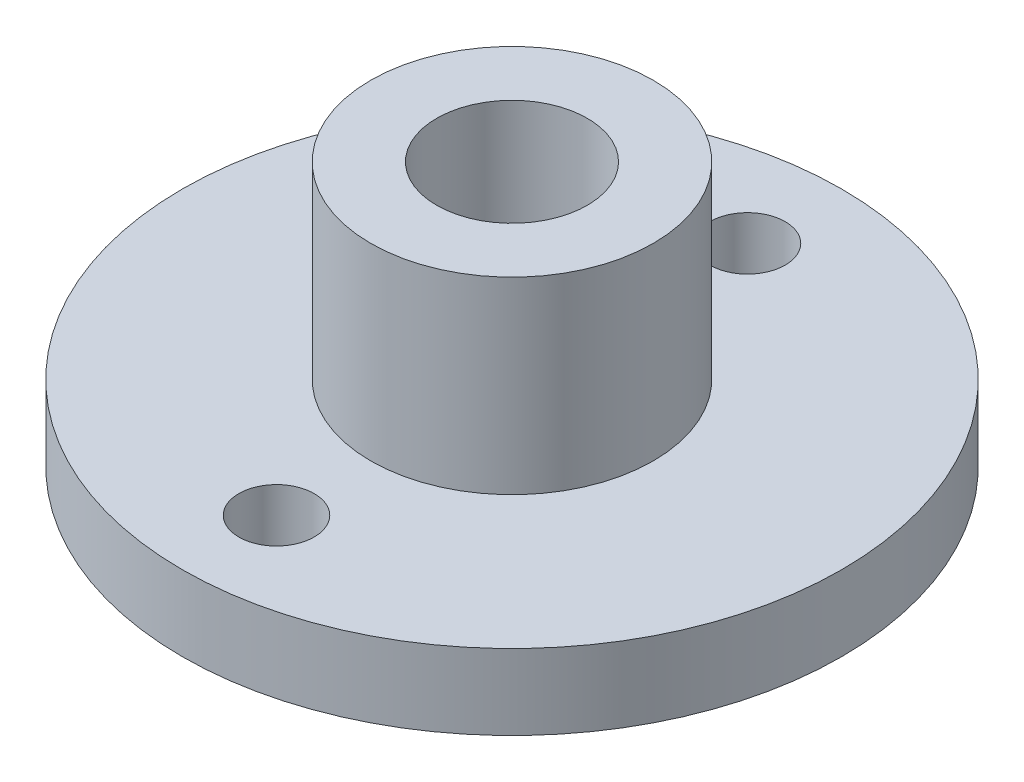
ISO-10303-21;
HEADER;
FILE_DESCRIPTION(('STEP AP214'),'2;1');
FILE_NAME('part.step','',(''),(''),'','','');
FILE_SCHEMA(('AUTOMOTIVE_DESIGN { 1 0 10303 214 1 1 1 1 }'));
ENDSEC;
DATA;
#1=APPLICATION_CONTEXT('core data for automotive mechanical design processes');
#2=APPLICATION_PROTOCOL_DEFINITION('international standard','automotive_design',2000,#1);
#3=PRODUCT_CONTEXT('',#1,'mechanical');
#4=PRODUCT('Part','Part','',(#3));
#5=PRODUCT_RELATED_PRODUCT_CATEGORY('part','',(#4));
#6=PRODUCT_DEFINITION_FORMATION('','',#4);
#7=PRODUCT_DEFINITION_CONTEXT('part definition',#1,'design');
#8=PRODUCT_DEFINITION('design','',#6,#7);
#9=PRODUCT_DEFINITION_SHAPE('','',#8);
#10=(LENGTH_UNIT() NAMED_UNIT(*) SI_UNIT(.MILLI.,.METRE.));
#11=(NAMED_UNIT(*) PLANE_ANGLE_UNIT() SI_UNIT($,.RADIAN.));
#12=(NAMED_UNIT(*) SI_UNIT($,.STERADIAN.) SOLID_ANGLE_UNIT());
#13=UNCERTAINTY_MEASURE_WITH_UNIT(LENGTH_MEASURE(1.E-05),#10,'distance_accuracy_value','');
#14=(GEOMETRIC_REPRESENTATION_CONTEXT(3) GLOBAL_UNCERTAINTY_ASSIGNED_CONTEXT((#13)) GLOBAL_UNIT_ASSIGNED_CONTEXT((#10,
#11,#12)) REPRESENTATION_CONTEXT('',''));
#15=CARTESIAN_POINT('',(0.,0.,0.));
#16=DIRECTION('',(0.,0.,1.));
#17=DIRECTION('',(1.,0.,0.));
#18=AXIS2_PLACEMENT_3D('',#15,#16,#17);
#19=CARTESIAN_POINT('',(0.,4.,0.));
#20=DIRECTION('',(0.,1.,0.));
#21=DIRECTION('',(0.,0.,1.));
#22=AXIS2_PLACEMENT_3D('',#19,#20,#21);
#23=PLANE('',#22);
#24=CARTESIAN_POINT('',(0.,4.,0.));
#25=DIRECTION('',(0.,1.,0.));
#26=DIRECTION('',(0.,0.,1.));
#27=AXIS2_PLACEMENT_3D('',#24,#25,#26);
#28=CIRCLE('',#27,7.5);
#29=CARTESIAN_POINT('',(0.,4.,7.5));
#30=VERTEX_POINT('',#29);
#31=EDGE_CURVE('E74',#30,#30,#28,.T.);
#32=ORIENTED_EDGE('',*,*,#31,.F.);
#33=EDGE_LOOP('',(#32));
#34=FACE_BOUND('',#33,.T.);
#35=CARTESIAN_POINT('',(0.,4.,-12.5));
#36=DIRECTION('',(0.,1.,0.));
#37=DIRECTION('',(0.,0.,1.));
#38=AXIS2_PLACEMENT_3D('',#35,#36,#37);
#39=CIRCLE('',#38,2.);
#40=CARTESIAN_POINT('',(0.,4.,-10.5));
#41=VERTEX_POINT('',#40);
#42=EDGE_CURVE('E56',#41,#41,#39,.T.);
#43=ORIENTED_EDGE('',*,*,#42,.F.);
#44=EDGE_LOOP('',(#43));
#45=FACE_BOUND('',#44,.T.);
#46=CARTESIAN_POINT('',(0.,4.,0.));
#47=DIRECTION('',(0.,1.,0.));
#48=DIRECTION('',(0.,0.,1.));
#49=AXIS2_PLACEMENT_3D('',#46,#47,#48);
#50=CIRCLE('',#49,17.5);
#51=CARTESIAN_POINT('',(0.,4.,17.5));
#52=VERTEX_POINT('',#51);
#53=EDGE_CURVE('E45',#52,#52,#50,.T.);
#54=ORIENTED_EDGE('',*,*,#53,.T.);
#55=EDGE_LOOP('',(#54));
#56=FACE_BOUND('',#55,.T.);
#57=CARTESIAN_POINT('',(0.,4.,12.5));
#58=DIRECTION('',(0.,1.,0.));
#59=DIRECTION('',(0.,0.,1.));
#60=AXIS2_PLACEMENT_3D('',#57,#58,#59);
#61=CIRCLE('',#60,2.);
#62=CARTESIAN_POINT('',(0.,4.,14.5));
#63=VERTEX_POINT('',#62);
#64=EDGE_CURVE('E62',#63,#63,#61,.T.);
#65=ORIENTED_EDGE('',*,*,#64,.F.);
#66=EDGE_LOOP('',(#65));
#67=FACE_BOUND('',#66,.T.);
#68=ADVANCED_FACE('F37',(#34,#45,#56,#67),#23,.T.);
#69=CARTESIAN_POINT('',(0.,0.,0.));
#70=DIRECTION('',(0.,1.,0.));
#71=DIRECTION('',(0.,0.,1.));
#72=AXIS2_PLACEMENT_3D('',#69,#70,#71);
#73=PLANE('',#72);
#74=CARTESIAN_POINT('',(0.,0.,0.));
#75=DIRECTION('',(0.,1.,0.));
#76=DIRECTION('',(0.,0.,1.));
#77=AXIS2_PLACEMENT_3D('',#74,#75,#76);
#78=CIRCLE('',#77,17.5);
#79=CARTESIAN_POINT('',(0.,0.,17.5));
#80=VERTEX_POINT('',#79);
#81=EDGE_CURVE('E50',#80,#80,#78,.T.);
#82=ORIENTED_EDGE('',*,*,#81,.F.);
#83=EDGE_LOOP('',(#82));
#84=FACE_BOUND('',#83,.T.);
#85=CARTESIAN_POINT('',(0.,0.,-12.5));
#86=DIRECTION('',(0.,1.,0.));
#87=DIRECTION('',(0.,0.,1.));
#88=AXIS2_PLACEMENT_3D('',#85,#86,#87);
#89=CIRCLE('',#88,2.);
#90=CARTESIAN_POINT('',(0.,0.,-10.5));
#91=VERTEX_POINT('',#90);
#92=EDGE_CURVE('E58',#91,#91,#89,.T.);
#93=ORIENTED_EDGE('',*,*,#92,.T.);
#94=EDGE_LOOP('',(#93));
#95=FACE_BOUND('',#94,.T.);
#96=CARTESIAN_POINT('',(0.,0.,12.5));
#97=DIRECTION('',(0.,1.,0.));
#98=DIRECTION('',(0.,0.,1.));
#99=AXIS2_PLACEMENT_3D('',#96,#97,#98);
#100=CIRCLE('',#99,2.);
#101=CARTESIAN_POINT('',(0.,0.,14.5));
#102=VERTEX_POINT('',#101);
#103=EDGE_CURVE('E66',#102,#102,#100,.T.);
#104=ORIENTED_EDGE('',*,*,#103,.T.);
#105=EDGE_LOOP('',(#104));
#106=FACE_BOUND('',#105,.T.);
#107=ADVANCED_FACE('F105',(#84,#95,#106),#73,.F.);
#108=CARTESIAN_POINT('',(0.,4.,0.));
#109=DIRECTION('',(0.,-1.,0.));
#110=DIRECTION('',(0.,0.,-1.));
#111=AXIS2_PLACEMENT_3D('',#108,#109,#110);
#112=CYLINDRICAL_SURFACE('',#111,17.5);
#113=ORIENTED_EDGE('',*,*,#53,.F.);
#114=EDGE_LOOP('',(#113));
#115=FACE_BOUND('',#114,.T.);
#116=ORIENTED_EDGE('',*,*,#81,.T.);
#117=EDGE_LOOP('',(#116));
#118=FACE_BOUND('',#117,.T.);
#119=ADVANCED_FACE('F39',(#115,#118),#112,.T.);
#120=CARTESIAN_POINT('',(0.,4.,-12.5));
#121=DIRECTION('',(0.,-1.,0.));
#122=DIRECTION('',(0.,0.,-1.));
#123=AXIS2_PLACEMENT_3D('',#120,#121,#122);
#124=CYLINDRICAL_SURFACE('',#123,2.);
#125=ORIENTED_EDGE('',*,*,#42,.T.);
#126=EDGE_LOOP('',(#125));
#127=FACE_BOUND('',#126,.T.);
#128=ORIENTED_EDGE('',*,*,#92,.F.);
#129=EDGE_LOOP('',(#128));
#130=FACE_BOUND('',#129,.T.);
#131=ADVANCED_FACE('F100',(#127,#130),#124,.F.);
#132=CARTESIAN_POINT('',(0.,4.,12.5));
#133=DIRECTION('',(0.,-1.,0.));
#134=DIRECTION('',(0.,0.,-1.));
#135=AXIS2_PLACEMENT_3D('',#132,#133,#134);
#136=CYLINDRICAL_SURFACE('',#135,2.);
#137=ORIENTED_EDGE('',*,*,#64,.T.);
#138=EDGE_LOOP('',(#137));
#139=FACE_BOUND('',#138,.T.);
#140=ORIENTED_EDGE('',*,*,#103,.F.);
#141=EDGE_LOOP('',(#140));
#142=FACE_BOUND('',#141,.T.);
#143=ADVANCED_FACE('F91',(#139,#142),#136,.F.);
#144=CARTESIAN_POINT('',(0.,14.,0.));
#145=DIRECTION('',(0.,1.,0.));
#146=DIRECTION('',(0.,0.,1.));
#147=AXIS2_PLACEMENT_3D('',#144,#145,#146);
#148=PLANE('',#147);
#149=CARTESIAN_POINT('',(0.,14.,0.));
#150=DIRECTION('',(0.,1.,0.));
#151=DIRECTION('',(0.,0.,1.));
#152=AXIS2_PLACEMENT_3D('',#149,#150,#151);
#153=CIRCLE('',#152,7.5);
#154=CARTESIAN_POINT('',(0.,14.,7.5));
#155=VERTEX_POINT('',#154);
#156=EDGE_CURVE('E70',#155,#155,#153,.T.);
#157=ORIENTED_EDGE('',*,*,#156,.T.);
#158=EDGE_LOOP('',(#157));
#159=FACE_BOUND('',#158,.T.);
#160=CARTESIAN_POINT('',(0.,14.,0.));
#161=DIRECTION('',(0.,1.,0.));
#162=DIRECTION('',(0.,0.,1.));
#163=AXIS2_PLACEMENT_3D('',#160,#161,#162);
#164=CIRCLE('',#163,4.);
#165=CARTESIAN_POINT('',(0.,14.,4.));
#166=VERTEX_POINT('',#165);
#167=EDGE_CURVE('E78',#166,#166,#164,.T.);
#168=ORIENTED_EDGE('',*,*,#167,.F.);
#169=EDGE_LOOP('',(#168));
#170=FACE_BOUND('',#169,.T.);
#171=ADVANCED_FACE('F88',(#159,#170),#148,.T.);
#172=CARTESIAN_POINT('',(0.,14.,0.));
#173=DIRECTION('',(0.,-1.,0.));
#174=DIRECTION('',(0.,0.,-1.));
#175=AXIS2_PLACEMENT_3D('',#172,#173,#174);
#176=CYLINDRICAL_SURFACE('',#175,7.5);
#177=ORIENTED_EDGE('',*,*,#156,.F.);
#178=EDGE_LOOP('',(#177));
#179=FACE_BOUND('',#178,.T.);
#180=ORIENTED_EDGE('',*,*,#31,.T.);
#181=EDGE_LOOP('',(#180));
#182=FACE_BOUND('',#181,.T.);
#183=ADVANCED_FACE('F90',(#179,#182),#176,.T.);
#184=CARTESIAN_POINT('',(0.,14.,0.));
#185=DIRECTION('',(0.,-1.,0.));
#186=DIRECTION('',(0.,0.,-1.));
#187=AXIS2_PLACEMENT_3D('',#184,#185,#186);
#188=CYLINDRICAL_SURFACE('',#187,4.);
#189=ORIENTED_EDGE('',*,*,#167,.T.);
#190=EDGE_LOOP('',(#189));
#191=FACE_BOUND('',#190,.T.);
#192=CARTESIAN_POINT('',(0.,4.,0.));
#193=DIRECTION('',(0.,1.,0.));
#194=DIRECTION('',(0.,0.,1.));
#195=AXIS2_PLACEMENT_3D('',#192,#193,#194);
#196=CIRCLE('',#195,4.);
#197=CARTESIAN_POINT('',(0.,4.,4.));
#198=VERTEX_POINT('',#197);
#199=EDGE_CURVE('E10',#198,#198,#196,.F.);
#200=ORIENTED_EDGE('',*,*,#199,.T.);
#201=EDGE_LOOP('',(#200));
#202=FACE_BOUND('',#201,.T.);
#203=ADVANCED_FACE('F86',(#191,#202),#188,.F.);
#204=ORIENTED_EDGE('',*,*,#199,.F.);
#205=EDGE_LOOP('',(#204));
#206=FACE_BOUND('',#205,.T.);
#207=ADVANCED_FACE('F108',(#206),#23,.T.);
#208=CLOSED_SHELL('',(#68,#107,#119,#131,#143,#171,#183,#203,#207));
#209=MANIFOLD_SOLID_BREP('B2',#208);
#210=ADVANCED_BREP_SHAPE_REPRESENTATION('',(#18,#209),#14);
#211=SHAPE_DEFINITION_REPRESENTATION(#9,#210);
ENDSEC;
END-ISO-10303-21;
